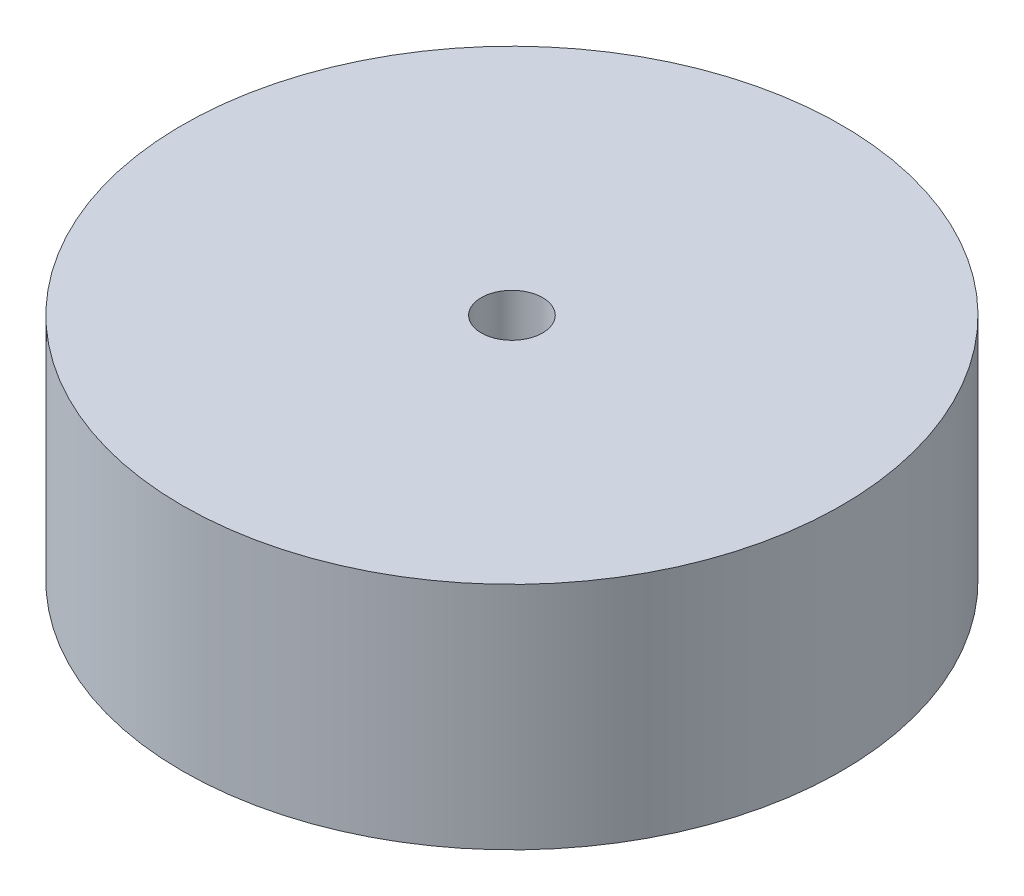
ISO-10303-21;
HEADER;
FILE_DESCRIPTION(('STEP AP214'),'2;1');
FILE_NAME('part.step','',(''),(''),'','','');
FILE_SCHEMA(('AUTOMOTIVE_DESIGN { 1 0 10303 214 1 1 1 1 }'));
ENDSEC;
DATA;
#1=APPLICATION_CONTEXT('core data for automotive mechanical design processes');
#2=APPLICATION_PROTOCOL_DEFINITION('international standard','automotive_design',2000,#1);
#3=PRODUCT_CONTEXT('',#1,'mechanical');
#4=PRODUCT('Part','Part','',(#3));
#5=PRODUCT_RELATED_PRODUCT_CATEGORY('part','',(#4));
#6=PRODUCT_DEFINITION_FORMATION('','',#4);
#7=PRODUCT_DEFINITION_CONTEXT('part definition',#1,'design');
#8=PRODUCT_DEFINITION('design','',#6,#7);
#9=PRODUCT_DEFINITION_SHAPE('','',#8);
#10=(LENGTH_UNIT() NAMED_UNIT(*) SI_UNIT(.MILLI.,.METRE.));
#11=(NAMED_UNIT(*) PLANE_ANGLE_UNIT() SI_UNIT($,.RADIAN.));
#12=(NAMED_UNIT(*) SI_UNIT($,.STERADIAN.) SOLID_ANGLE_UNIT());
#13=UNCERTAINTY_MEASURE_WITH_UNIT(LENGTH_MEASURE(1.E-05),#10,'distance_accuracy_value','');
#14=(GEOMETRIC_REPRESENTATION_CONTEXT(3) GLOBAL_UNCERTAINTY_ASSIGNED_CONTEXT((#13)) GLOBAL_UNIT_ASSIGNED_CONTEXT((#10,
#11,#12)) REPRESENTATION_CONTEXT('',''));
#15=CARTESIAN_POINT('',(0.,0.,0.));
#16=DIRECTION('',(0.,0.,1.));
#17=DIRECTION('',(1.,0.,0.));
#18=AXIS2_PLACEMENT_3D('',#15,#16,#17);
#19=CARTESIAN_POINT('',(0.,15.,0.));
#20=DIRECTION('',(0.,-1.,0.));
#21=DIRECTION('',(0.,0.,-1.));
#22=AXIS2_PLACEMENT_3D('',#19,#20,#21);
#23=CYLINDRICAL_SURFACE('',#22,21.5);
#24=CARTESIAN_POINT('',(0.,15.,0.));
#25=DIRECTION('',(0.,1.,0.));
#26=DIRECTION('',(0.,0.,1.));
#27=AXIS2_PLACEMENT_3D('',#24,#25,#26);
#28=CIRCLE('',#27,21.5);
#29=CARTESIAN_POINT('',(0.,15.,21.5));
#30=VERTEX_POINT('',#29);
#31=EDGE_CURVE('E10',#30,#30,#28,.T.);
#32=ORIENTED_EDGE('',*,*,#31,.F.);
#33=EDGE_LOOP('',(#32));
#34=FACE_BOUND('',#33,.T.);
#35=CARTESIAN_POINT('',(0.,0.,0.));
#36=DIRECTION('',(0.,1.,0.));
#37=DIRECTION('',(0.,0.,1.));
#38=AXIS2_PLACEMENT_3D('',#35,#36,#37);
#39=CIRCLE('',#38,21.5);
#40=CARTESIAN_POINT('',(0.,0.,21.5));
#41=VERTEX_POINT('',#40);
#42=EDGE_CURVE('E51',#41,#41,#39,.T.);
#43=ORIENTED_EDGE('',*,*,#42,.T.);
#44=EDGE_LOOP('',(#43));
#45=FACE_BOUND('',#44,.T.);
#46=ADVANCED_FACE('F43',(#34,#45),#23,.T.);
#47=CARTESIAN_POINT('',(0.,15.,0.));
#48=DIRECTION('',(0.,1.,0.));
#49=DIRECTION('',(0.,0.,1.));
#50=AXIS2_PLACEMENT_3D('',#47,#48,#49);
#51=PLANE('',#50);
#52=CARTESIAN_POINT('',(0.,15.,0.));
#53=DIRECTION('',(0.,1.,0.));
#54=DIRECTION('',(0.,0.,1.));
#55=AXIS2_PLACEMENT_3D('',#52,#53,#54);
#56=CIRCLE('',#55,2.);
#57=CARTESIAN_POINT('',(0.,15.,2.));
#58=VERTEX_POINT('',#57);
#59=EDGE_CURVE('E57',#58,#58,#56,.F.);
#60=ORIENTED_EDGE('',*,*,#59,.T.);
#61=EDGE_LOOP('',(#60));
#62=FACE_BOUND('',#61,.T.);
#63=ORIENTED_EDGE('',*,*,#31,.T.);
#64=EDGE_LOOP('',(#63));
#65=FACE_BOUND('',#64,.T.);
#66=ADVANCED_FACE('F72',(#62,#65),#51,.T.);
#67=CARTESIAN_POINT('',(0.,0.,0.));
#68=DIRECTION('',(0.,1.,0.));
#69=DIRECTION('',(0.,0.,1.));
#70=AXIS2_PLACEMENT_3D('',#67,#68,#69);
#71=PLANE('',#70);
#72=CARTESIAN_POINT('',(0.,0.,0.));
#73=DIRECTION('',(0.,1.,0.));
#74=DIRECTION('',(0.,0.,1.));
#75=AXIS2_PLACEMENT_3D('',#72,#73,#74);
#76=CIRCLE('',#75,2.);
#77=CARTESIAN_POINT('',(0.,0.,2.));
#78=VERTEX_POINT('',#77);
#79=EDGE_CURVE('E46',#78,#78,#76,.F.);
#80=ORIENTED_EDGE('',*,*,#79,.F.);
#81=EDGE_LOOP('',(#80));
#82=FACE_BOUND('',#81,.T.);
#83=ORIENTED_EDGE('',*,*,#42,.F.);
#84=EDGE_LOOP('',(#83));
#85=FACE_BOUND('',#84,.T.);
#86=ADVANCED_FACE('F69',(#82,#85),#71,.F.);
#87=CARTESIAN_POINT('',(0.,26.,0.));
#88=DIRECTION('',(0.,-1.,0.));
#89=DIRECTION('',(0.,0.,-1.));
#90=AXIS2_PLACEMENT_3D('',#87,#88,#89);
#91=CYLINDRICAL_SURFACE('',#90,2.);
#92=ORIENTED_EDGE('',*,*,#59,.F.);
#93=EDGE_LOOP('',(#92));
#94=FACE_BOUND('',#93,.T.);
#95=ORIENTED_EDGE('',*,*,#79,.T.);
#96=EDGE_LOOP('',(#95));
#97=FACE_BOUND('',#96,.T.);
#98=ADVANCED_FACE('F67',(#94,#97),#91,.F.);
#99=CLOSED_SHELL('',(#46,#66,#86,#98));
#100=MANIFOLD_SOLID_BREP('B2',#99);
#101=ADVANCED_BREP_SHAPE_REPRESENTATION('',(#18,#100),#14);
#102=SHAPE_DEFINITION_REPRESENTATION(#9,#101);
ENDSEC;
END-ISO-10303-21;
